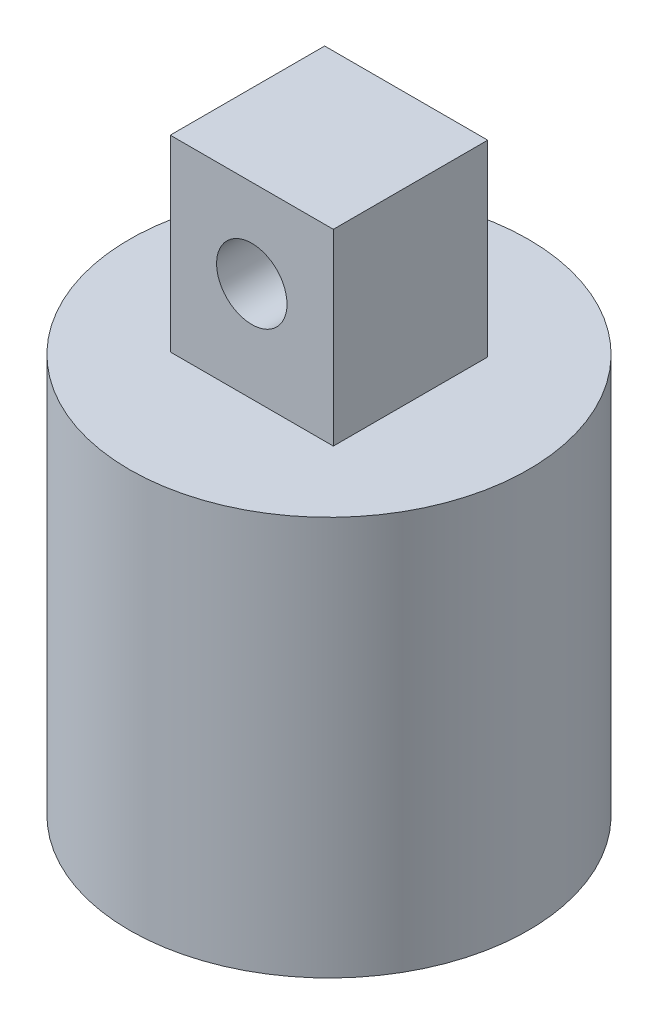
ISO-10303-21;
HEADER;
FILE_DESCRIPTION(('STEP AP214'),'2;1');
FILE_NAME('part.step','',(''),(''),'','','');
FILE_SCHEMA(('AUTOMOTIVE_DESIGN { 1 0 10303 214 1 1 1 1 }'));
ENDSEC;
DATA;
#1=APPLICATION_CONTEXT('core data for automotive mechanical design processes');
#2=APPLICATION_PROTOCOL_DEFINITION('international standard','automotive_design',2000,#1);
#3=PRODUCT_CONTEXT('',#1,'mechanical');
#4=PRODUCT('Part','Part','',(#3));
#5=PRODUCT_RELATED_PRODUCT_CATEGORY('part','',(#4));
#6=PRODUCT_DEFINITION_FORMATION('','',#4);
#7=PRODUCT_DEFINITION_CONTEXT('part definition',#1,'design');
#8=PRODUCT_DEFINITION('design','',#6,#7);
#9=PRODUCT_DEFINITION_SHAPE('','',#8);
#10=(LENGTH_UNIT() NAMED_UNIT(*) SI_UNIT(.MILLI.,.METRE.));
#11=(NAMED_UNIT(*) PLANE_ANGLE_UNIT() SI_UNIT($,.RADIAN.));
#12=(NAMED_UNIT(*) SI_UNIT($,.STERADIAN.) SOLID_ANGLE_UNIT());
#13=UNCERTAINTY_MEASURE_WITH_UNIT(LENGTH_MEASURE(1.E-05),#10,'distance_accuracy_value','');
#14=(GEOMETRIC_REPRESENTATION_CONTEXT(3) GLOBAL_UNCERTAINTY_ASSIGNED_CONTEXT((#13)) GLOBAL_UNIT_ASSIGNED_CONTEXT((#10,
#11,#12)) REPRESENTATION_CONTEXT('',''));
#15=CARTESIAN_POINT('',(0.,0.,0.));
#16=DIRECTION('',(0.,0.,1.));
#17=DIRECTION('',(1.,0.,0.));
#18=AXIS2_PLACEMENT_3D('',#15,#16,#17);
#19=CARTESIAN_POINT('',(0.,2.,0.));
#20=DIRECTION('',(0.,-1.,0.));
#21=DIRECTION('',(0.,0.,-1.));
#22=AXIS2_PLACEMENT_3D('',#19,#20,#21);
#23=CYLINDRICAL_SURFACE('',#22,8.5);
#24=CARTESIAN_POINT('',(0.,2.,0.));
#25=DIRECTION('',(0.,1.,0.));
#26=DIRECTION('',(0.,0.,1.));
#27=AXIS2_PLACEMENT_3D('',#24,#25,#26);
#28=CIRCLE('',#27,8.5);
#29=CARTESIAN_POINT('',(0.,2.,8.5));
#30=VERTEX_POINT('',#29);
#31=EDGE_CURVE('E11',#30,#30,#28,.T.);
#32=ORIENTED_EDGE('',*,*,#31,.F.);
#33=EDGE_LOOP('',(#32));
#34=FACE_BOUND('',#33,.T.);
#35=CARTESIAN_POINT('',(0.,-15.,0.));
#36=DIRECTION('',(0.,1.,0.));
#37=DIRECTION('',(0.,0.,1.));
#38=AXIS2_PLACEMENT_3D('',#35,#36,#37);
#39=CIRCLE('',#38,8.5);
#40=CARTESIAN_POINT('',(0.,-15.,8.5));
#41=VERTEX_POINT('',#40);
#42=EDGE_CURVE('E119',#41,#41,#39,.T.);
#43=ORIENTED_EDGE('',*,*,#42,.T.);
#44=EDGE_LOOP('',(#43));
#45=FACE_BOUND('',#44,.T.);
#46=ADVANCED_FACE('F39',(#34,#45),#23,.T.);
#47=CARTESIAN_POINT('',(0.,2.,0.));
#48=DIRECTION('',(0.,1.,0.));
#49=DIRECTION('',(0.,0.,1.));
#50=AXIS2_PLACEMENT_3D('',#47,#48,#49);
#51=PLANE('',#50);
#52=DIRECTION('',(0.,0.,-1.));
#53=VECTOR('',#52,1.);
#54=CARTESIAN_POINT('',(3.47437827378932,2.,3.28946738526833));
#55=LINE('',#54,#53);
#56=CARTESIAN_POINT('',(3.47437827378932,2.,3.28946738526833));
#57=VERTEX_POINT('',#56);
#58=CARTESIAN_POINT('',(3.47437827378932,2.,-3.28946738526833));
#59=VERTEX_POINT('',#58);
#60=EDGE_CURVE('E53',#57,#59,#55,.T.);
#61=ORIENTED_EDGE('',*,*,#60,.F.);
#62=DIRECTION('',(1.,0.,0.));
#63=VECTOR('',#62,1.);
#64=CARTESIAN_POINT('',(-3.47437827378932,2.,3.28946738526833));
#65=LINE('',#64,#63);
#66=CARTESIAN_POINT('',(-3.47437827378932,2.,3.28946738526833));
#67=VERTEX_POINT('',#66);
#68=EDGE_CURVE('E57',#67,#57,#65,.T.);
#69=ORIENTED_EDGE('',*,*,#68,.F.);
#70=DIRECTION('',(0.,0.,1.));
#71=VECTOR('',#70,1.);
#72=CARTESIAN_POINT('',(-3.47437827378932,2.,3.28946738526833));
#73=LINE('',#72,#71);
#74=CARTESIAN_POINT('',(-3.47437827378932,2.,-3.28946738526833));
#75=VERTEX_POINT('',#74);
#76=EDGE_CURVE('E106',#75,#67,#73,.T.);
#77=ORIENTED_EDGE('',*,*,#76,.F.);
#78=DIRECTION('',(-1.,0.,0.));
#79=VECTOR('',#78,1.);
#80=CARTESIAN_POINT('',(-3.47437827378932,2.,-3.28946738526833));
#81=LINE('',#80,#79);
#82=EDGE_CURVE('E108',#59,#75,#81,.T.);
#83=ORIENTED_EDGE('',*,*,#82,.F.);
#84=EDGE_LOOP('',(#61,#69,#77,#83));
#85=FACE_BOUND('',#84,.T.);
#86=ORIENTED_EDGE('',*,*,#31,.T.);
#87=EDGE_LOOP('',(#86));
#88=FACE_BOUND('',#87,.T.);
#89=ADVANCED_FACE('F145',(#85,#88),#51,.T.);
#90=CARTESIAN_POINT('',(3.47437827378932,10.,3.28946738526833));
#91=DIRECTION('',(-1.,0.,0.));
#92=DIRECTION('',(0.,0.,1.));
#93=AXIS2_PLACEMENT_3D('',#90,#91,#92);
#94=PLANE('',#93);
#95=ORIENTED_EDGE('',*,*,#60,.T.);
#96=DIRECTION('',(0.,-1.,0.));
#97=VECTOR('',#96,1.);
#98=CARTESIAN_POINT('',(3.47437827378932,10.,-3.28946738526833));
#99=LINE('',#98,#97);
#100=CARTESIAN_POINT('',(3.47437827378932,10.,-3.28946738526833));
#101=VERTEX_POINT('',#100);
#102=EDGE_CURVE('E46',#101,#59,#99,.T.);
#103=ORIENTED_EDGE('',*,*,#102,.F.);
#104=DIRECTION('',(0.,0.,-1.));
#105=VECTOR('',#104,1.);
#106=CARTESIAN_POINT('',(3.47437827378932,10.,3.28946738526833));
#107=LINE('',#106,#105);
#108=CARTESIAN_POINT('',(3.47437827378932,10.,3.28946738526833));
#109=VERTEX_POINT('',#108);
#110=EDGE_CURVE('E87',#109,#101,#107,.T.);
#111=ORIENTED_EDGE('',*,*,#110,.F.);
#112=DIRECTION('',(0.,-1.,0.));
#113=VECTOR('',#112,1.);
#114=CARTESIAN_POINT('',(3.47437827378932,10.,3.28946738526833));
#115=LINE('',#114,#113);
#116=EDGE_CURVE('E103',#109,#57,#115,.T.);
#117=ORIENTED_EDGE('',*,*,#116,.T.);
#118=EDGE_LOOP('',(#95,#103,#111,#117));
#119=FACE_BOUND('',#118,.T.);
#120=ADVANCED_FACE('F97',(#119),#94,.F.);
#121=CARTESIAN_POINT('',(-3.47437827378932,10.,-3.28946738526833));
#122=DIRECTION('',(0.,0.,1.));
#123=DIRECTION('',(1.,0.,0.));
#124=AXIS2_PLACEMENT_3D('',#121,#122,#123);
#125=PLANE('',#124);
#126=CARTESIAN_POINT('',(0.,6.24836968279013,-3.28946738526833));
#127=DIRECTION('',(0.,0.,1.));
#128=DIRECTION('',(1.,0.,0.));
#129=AXIS2_PLACEMENT_3D('',#126,#127,#128);
#130=CIRCLE('',#129,1.5);
#131=CARTESIAN_POINT('',(1.5,6.24836968279013,-3.28946738526833));
#132=VERTEX_POINT('',#131);
#133=EDGE_CURVE('E111',#132,#132,#130,.T.);
#134=ORIENTED_EDGE('',*,*,#133,.T.);
#135=EDGE_LOOP('',(#134));
#136=FACE_BOUND('',#135,.T.);
#137=ORIENTED_EDGE('',*,*,#82,.T.);
#138=DIRECTION('',(0.,-1.,0.));
#139=VECTOR('',#138,1.);
#140=CARTESIAN_POINT('',(-3.47437827378932,10.,-3.28946738526833));
#141=LINE('',#140,#139);
#142=CARTESIAN_POINT('',(-3.47437827378932,10.,-3.28946738526833));
#143=VERTEX_POINT('',#142);
#144=EDGE_CURVE('E83',#143,#75,#141,.T.);
#145=ORIENTED_EDGE('',*,*,#144,.F.);
#146=DIRECTION('',(-1.,0.,0.));
#147=VECTOR('',#146,1.);
#148=CARTESIAN_POINT('',(-3.47437827378932,10.,-3.28946738526833));
#149=LINE('',#148,#147);
#150=EDGE_CURVE('E77',#101,#143,#149,.T.);
#151=ORIENTED_EDGE('',*,*,#150,.F.);
#152=ORIENTED_EDGE('',*,*,#102,.T.);
#153=EDGE_LOOP('',(#137,#145,#151,#152));
#154=FACE_BOUND('',#153,.T.);
#155=ADVANCED_FACE('F80',(#136,#154),#125,.F.);
#156=CARTESIAN_POINT('',(-3.47437827378932,10.,3.28946738526833));
#157=DIRECTION('',(1.,0.,0.));
#158=DIRECTION('',(0.,0.,-1.));
#159=AXIS2_PLACEMENT_3D('',#156,#157,#158);
#160=PLANE('',#159);
#161=ORIENTED_EDGE('',*,*,#76,.T.);
#162=DIRECTION('',(0.,-1.,0.));
#163=VECTOR('',#162,1.);
#164=CARTESIAN_POINT('',(-3.47437827378932,10.,3.28946738526833));
#165=LINE('',#164,#163);
#166=CARTESIAN_POINT('',(-3.47437827378932,10.,3.28946738526833));
#167=VERTEX_POINT('',#166);
#168=EDGE_CURVE('E98',#167,#67,#165,.T.);
#169=ORIENTED_EDGE('',*,*,#168,.F.);
#170=DIRECTION('',(0.,0.,1.));
#171=VECTOR('',#170,1.);
#172=CARTESIAN_POINT('',(-3.47437827378932,10.,3.28946738526833));
#173=LINE('',#172,#171);
#174=EDGE_CURVE('E86',#143,#167,#173,.T.);
#175=ORIENTED_EDGE('',*,*,#174,.F.);
#176=ORIENTED_EDGE('',*,*,#144,.T.);
#177=EDGE_LOOP('',(#161,#169,#175,#176));
#178=FACE_BOUND('',#177,.T.);
#179=ADVANCED_FACE('F160',(#178),#160,.F.);
#180=CARTESIAN_POINT('',(-3.47437827378932,10.,3.28946738526833));
#181=DIRECTION('',(0.,0.,-1.));
#182=DIRECTION('',(-1.,0.,0.));
#183=AXIS2_PLACEMENT_3D('',#180,#181,#182);
#184=PLANE('',#183);
#185=CARTESIAN_POINT('',(0.,6.24836968279013,3.28946738526833));
#186=DIRECTION('',(0.,0.,1.));
#187=DIRECTION('',(1.,0.,0.));
#188=AXIS2_PLACEMENT_3D('',#185,#186,#187);
#189=CIRCLE('',#188,1.5);
#190=CARTESIAN_POINT('',(1.5,6.24836968279013,3.28946738526833));
#191=VERTEX_POINT('',#190);
#192=EDGE_CURVE('E116',#191,#191,#189,.T.);
#193=ORIENTED_EDGE('',*,*,#192,.F.);
#194=EDGE_LOOP('',(#193));
#195=FACE_BOUND('',#194,.T.);
#196=ORIENTED_EDGE('',*,*,#68,.T.);
#197=ORIENTED_EDGE('',*,*,#116,.F.);
#198=DIRECTION('',(1.,0.,0.));
#199=VECTOR('',#198,1.);
#200=CARTESIAN_POINT('',(-3.47437827378932,10.,3.28946738526833));
#201=LINE('',#200,#199);
#202=EDGE_CURVE('E92',#167,#109,#201,.T.);
#203=ORIENTED_EDGE('',*,*,#202,.F.);
#204=ORIENTED_EDGE('',*,*,#168,.T.);
#205=EDGE_LOOP('',(#196,#197,#203,#204));
#206=FACE_BOUND('',#205,.T.);
#207=ADVANCED_FACE('F164',(#195,#206),#184,.F.);
#208=CARTESIAN_POINT('',(0.,10.,0.));
#209=DIRECTION('',(0.,-1.,0.));
#210=DIRECTION('',(0.,0.,-1.));
#211=AXIS2_PLACEMENT_3D('',#208,#209,#210);
#212=PLANE('',#211);
#213=ORIENTED_EDGE('',*,*,#110,.T.);
#214=ORIENTED_EDGE('',*,*,#150,.T.);
#215=ORIENTED_EDGE('',*,*,#174,.T.);
#216=ORIENTED_EDGE('',*,*,#202,.T.);
#217=EDGE_LOOP('',(#213,#214,#215,#216));
#218=FACE_BOUND('',#217,.T.);
#219=ADVANCED_FACE('F90',(#218),#212,.F.);
#220=CARTESIAN_POINT('',(0.,6.24836968279013,-4.71053261473167));
#221=DIRECTION('',(0.,0.,1.));
#222=DIRECTION('',(1.,0.,0.));
#223=AXIS2_PLACEMENT_3D('',#220,#221,#222);
#224=CYLINDRICAL_SURFACE('',#223,1.5);
#225=ORIENTED_EDGE('',*,*,#192,.T.);
#226=EDGE_LOOP('',(#225));
#227=FACE_BOUND('',#226,.T.);
#228=ORIENTED_EDGE('',*,*,#133,.F.);
#229=EDGE_LOOP('',(#228));
#230=FACE_BOUND('',#229,.T.);
#231=ADVANCED_FACE('F140',(#227,#230),#224,.F.);
#232=CARTESIAN_POINT('',(0.,-15.,0.));
#233=DIRECTION('',(0.,1.,0.));
#234=DIRECTION('',(0.,0.,1.));
#235=AXIS2_PLACEMENT_3D('',#232,#233,#234);
#236=PLANE('',#235);
#237=CARTESIAN_POINT('',(0.,-15.,0.));
#238=DIRECTION('',(0.,-1.,0.));
#239=DIRECTION('',(0.,0.,-1.));
#240=AXIS2_PLACEMENT_3D('',#237,#238,#239);
#241=CIRCLE('',#240,7.);
#242=CARTESIAN_POINT('',(0.,-15.,-7.));
#243=VERTEX_POINT('',#242);
#244=EDGE_CURVE('E123',#243,#243,#241,.T.);
#245=ORIENTED_EDGE('',*,*,#244,.F.);
#246=EDGE_LOOP('',(#245));
#247=FACE_BOUND('',#246,.T.);
#248=ORIENTED_EDGE('',*,*,#42,.F.);
#249=EDGE_LOOP('',(#248));
#250=FACE_BOUND('',#249,.T.);
#251=ADVANCED_FACE('F134',(#247,#250),#236,.F.);
#252=CARTESIAN_POINT('',(0.,0.,0.));
#253=DIRECTION('',(0.,-1.,0.));
#254=DIRECTION('',(0.,0.,-1.));
#255=AXIS2_PLACEMENT_3D('',#252,#253,#254);
#256=CYLINDRICAL_SURFACE('',#255,7.);
#257=CARTESIAN_POINT('',(0.,0.,0.));
#258=DIRECTION('',(0.,-1.,0.));
#259=DIRECTION('',(0.,0.,-1.));
#260=AXIS2_PLACEMENT_3D('',#257,#258,#259);
#261=CIRCLE('',#260,7.);
#262=CARTESIAN_POINT('',(0.,0.,-7.));
#263=VERTEX_POINT('',#262);
#264=EDGE_CURVE('E122',#263,#263,#261,.T.);
#265=ORIENTED_EDGE('',*,*,#264,.F.);
#266=EDGE_LOOP('',(#265));
#267=FACE_BOUND('',#266,.T.);
#268=ORIENTED_EDGE('',*,*,#244,.T.);
#269=EDGE_LOOP('',(#268));
#270=FACE_BOUND('',#269,.T.);
#271=ADVANCED_FACE('F131',(#267,#270),#256,.F.);
#272=CARTESIAN_POINT('',(0.,0.,0.));
#273=DIRECTION('',(0.,-1.,0.));
#274=DIRECTION('',(0.,0.,-1.));
#275=AXIS2_PLACEMENT_3D('',#272,#273,#274);
#276=PLANE('',#275);
#277=ORIENTED_EDGE('',*,*,#264,.T.);
#278=EDGE_LOOP('',(#277));
#279=FACE_BOUND('',#278,.T.);
#280=ADVANCED_FACE('F129',(#279),#276,.T.);
#281=CLOSED_SHELL('',(#46,#89,#120,#155,#179,#207,#219,#231,#251,#271,#280));
#282=MANIFOLD_SOLID_BREP('B2',#281);
#283=ADVANCED_BREP_SHAPE_REPRESENTATION('',(#18,#282),#14);
#284=SHAPE_DEFINITION_REPRESENTATION(#9,#283);
ENDSEC;
END-ISO-10303-21;
